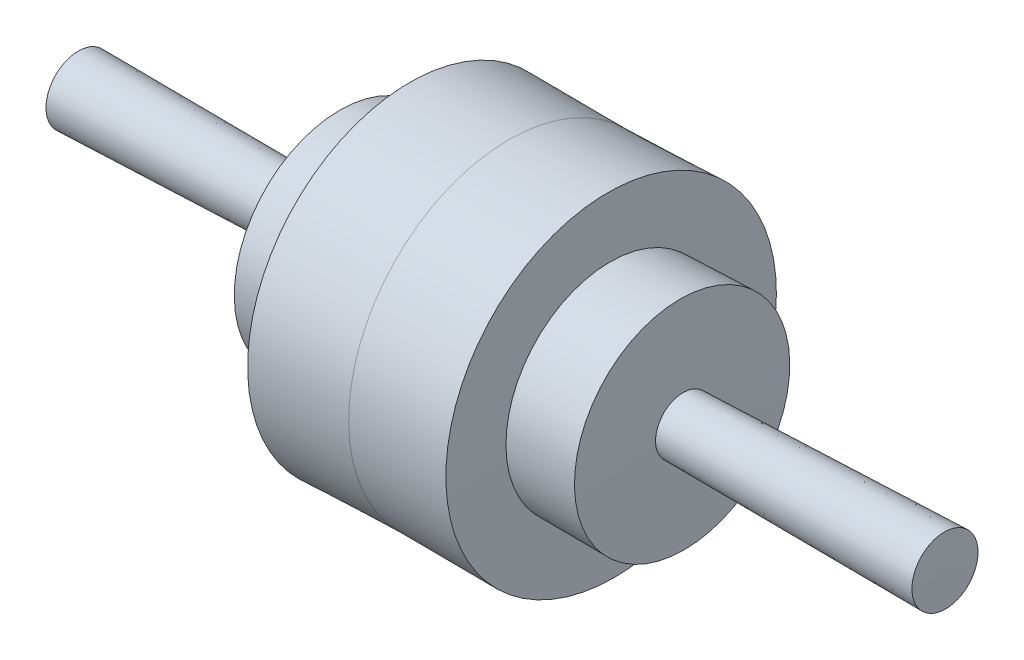
ISO-10303-21;
HEADER;
FILE_DESCRIPTION(('STEP AP214'),'2;1');
FILE_NAME('part.step','',(''),(''),'','','');
FILE_SCHEMA(('AUTOMOTIVE_DESIGN { 1 0 10303 214 1 1 1 1 }'));
ENDSEC;
DATA;
#1=APPLICATION_CONTEXT('core data for automotive mechanical design processes');
#2=APPLICATION_PROTOCOL_DEFINITION('international standard','automotive_design',2000,#1);
#3=PRODUCT_CONTEXT('',#1,'mechanical');
#4=PRODUCT('Part','Part','',(#3));
#5=PRODUCT_RELATED_PRODUCT_CATEGORY('part','',(#4));
#6=PRODUCT_DEFINITION_FORMATION('','',#4);
#7=PRODUCT_DEFINITION_CONTEXT('part definition',#1,'design');
#8=PRODUCT_DEFINITION('design','',#6,#7);
#9=PRODUCT_DEFINITION_SHAPE('','',#8);
#10=(LENGTH_UNIT() NAMED_UNIT(*) SI_UNIT(.MILLI.,.METRE.));
#11=(NAMED_UNIT(*) PLANE_ANGLE_UNIT() SI_UNIT($,.RADIAN.));
#12=(NAMED_UNIT(*) SI_UNIT($,.STERADIAN.) SOLID_ANGLE_UNIT());
#13=UNCERTAINTY_MEASURE_WITH_UNIT(LENGTH_MEASURE(1.E-05),#10,'distance_accuracy_value','');
#14=(GEOMETRIC_REPRESENTATION_CONTEXT(3) GLOBAL_UNCERTAINTY_ASSIGNED_CONTEXT((#13)) GLOBAL_UNIT_ASSIGNED_CONTEXT((#10,
#11,#12)) REPRESENTATION_CONTEXT('',''));
#15=CARTESIAN_POINT('',(0.,0.,0.));
#16=DIRECTION('',(0.,0.,1.));
#17=DIRECTION('',(1.,0.,0.));
#18=AXIS2_PLACEMENT_3D('',#15,#16,#17);
#19=CARTESIAN_POINT('',(-51.92007745854,-0.985960103291799,0.));
#20=DIRECTION('',(-0.999819739495317,-0.0189865351108762,0.));
#21=DIRECTION('',(0.0189865351108762,-0.999819739495317,0.));
#22=AXIS2_PLACEMENT_3D('',#19,#20,#21);
#23=CONICAL_SURFACE('',#22,8.4962984432941,0.0189876760339423);
#24=CARTESIAN_POINT('',(-130.994933695762,-2.48758832188784,0.));
#25=DIRECTION('',(-0.999819739495317,-0.0189865351108762,0.));
#26=DIRECTION('',(0.0189865351108762,-0.999819739495317,0.));
#27=AXIS2_PLACEMENT_3D('',#24,#25,#26);
#28=CIRCLE('',#27,9.99819739495315);
#29=CARTESIAN_POINT('',(-130.805102569878,-12.4839834367327,0.));
#30=VERTEX_POINT('',#29);
#31=EDGE_CURVE('E57',#30,#30,#28,.T.);
#32=ORIENTED_EDGE('',*,*,#31,.F.);
#33=EDGE_LOOP('',(#32));
#34=FACE_BOUND('',#33,.T.);
#35=CARTESIAN_POINT('',(-51.92007745854,-0.985960103291799,0.));
#36=DIRECTION('',(-0.999819739495317,-0.0189865351108762,0.));
#37=DIRECTION('',(0.0189865351108762,-0.999819739495317,0.));
#38=AXIS2_PLACEMENT_3D('',#35,#36,#37);
#39=CIRCLE('',#38,8.4962984432941);
#40=CARTESIAN_POINT('',(-52.0813927272461,7.50880679295703,0.));
#41=VERTEX_POINT('',#40);
#42=EDGE_CURVE('E11',#41,#41,#39,.T.);
#43=ORIENTED_EDGE('',*,*,#42,.T.);
#44=EDGE_LOOP('',(#43));
#45=FACE_BOUND('',#44,.T.);
#46=ADVANCED_FACE('F33',(#34,#45),#23,.T.);
#47=CARTESIAN_POINT('',(-51.4631342870471,-0.977282771542373,0.));
#48=DIRECTION('',(0.999819739495317,0.0189865351108762,0.));
#49=DIRECTION('',(-0.0189865351108762,0.999819739495317,0.));
#50=AXIS2_PLACEMENT_3D('',#47,#48,#49);
#51=CONICAL_SURFACE('',#50,32.5629945953029,1.55180865076095);
#52=CARTESIAN_POINT('',(-51.4631342870471,-0.977282771542373,0.));
#53=DIRECTION('',(-0.999819739495317,-0.0189865351108762,0.));
#54=DIRECTION('',(0.0189865351108762,-0.999819739495317,0.));
#55=AXIS2_PLACEMENT_3D('',#52,#53,#54);
#56=CIRCLE('',#55,32.5629945953029);
#57=CARTESIAN_POINT('',(-52.0813927272461,31.5798420019206,0.));
#58=VERTEX_POINT('',#57);
#59=EDGE_CURVE('E40',#58,#58,#56,.T.);
#60=CARTESIAN_POINT('',(-52.0813927272461,7.50880679295703,0.));
#61=CARTESIAN_POINT('',(-52.0813927272461,7.75954674305041,0.));
#62=CARTESIAN_POINT('',(-52.0813927272461,8.01028669314378,0.));
#63=CARTESIAN_POINT('',(-52.0813927272461,8.51176659333052,0.));
#64=CARTESIAN_POINT('',(-52.0813927272461,8.76250654342389,0.));
#65=CARTESIAN_POINT('',(-52.0813927272461,9.26398644361063,0.));
#66=CARTESIAN_POINT('',(-52.0813927272461,9.514726393704,0.));
#67=CARTESIAN_POINT('',(-52.0813927272461,10.0162062938907,0.));
#68=CARTESIAN_POINT('',(-52.0813927272461,10.2669462439841,0.));
#69=CARTESIAN_POINT('',(-52.0813927272461,10.7684261441708,0.));
#70=CARTESIAN_POINT('',(-52.0813927272461,11.0191660942642,0.));
#71=CARTESIAN_POINT('',(-52.0813927272461,11.520645994451,0.));
#72=CARTESIAN_POINT('',(-52.0813927272461,11.7713859445443,0.));
#73=CARTESIAN_POINT('',(-52.0813927272461,12.2728658447311,0.));
#74=CARTESIAN_POINT('',(-52.0813927272461,12.5236057948244,0.));
#75=CARTESIAN_POINT('',(-52.0813927272461,13.0250856950112,0.));
#76=CARTESIAN_POINT('',(-52.0813927272461,13.2758256451046,0.));
#77=CARTESIAN_POINT('',(-52.0813927272461,13.7773055452913,0.));
#78=CARTESIAN_POINT('',(-52.0813927272461,14.0280454953847,0.));
#79=CARTESIAN_POINT('',(-52.0813927272461,14.5295253955714,0.));
#80=CARTESIAN_POINT('',(-52.0813927272461,14.7802653456648,0.));
#81=CARTESIAN_POINT('',(-52.0813927272461,15.2817452458515,0.));
#82=CARTESIAN_POINT('',(-52.0813927272461,15.5324851959449,0.));
#83=CARTESIAN_POINT('',(-52.0813927272461,16.0339650961316,0.));
#84=CARTESIAN_POINT('',(-52.0813927272461,16.284705046225,0.));
#85=CARTESIAN_POINT('',(-52.0813927272461,16.7861849464117,0.));
#86=CARTESIAN_POINT('',(-52.0813927272461,17.0369248965051,0.));
#87=CARTESIAN_POINT('',(-52.0813927272461,17.5384047966918,0.));
#88=CARTESIAN_POINT('',(-52.0813927272461,17.7891447467852,0.));
#89=CARTESIAN_POINT('',(-52.0813927272461,18.290624646972,0.));
#90=CARTESIAN_POINT('',(-52.0813927272461,18.5413645970653,0.));
#91=CARTESIAN_POINT('',(-52.0813927272461,19.0428444972521,0.));
#92=CARTESIAN_POINT('',(-52.0813927272461,19.2935844473454,0.));
#93=CARTESIAN_POINT('',(-52.0813927272461,19.7950643475322,0.));
#94=CARTESIAN_POINT('',(-52.0813927272461,20.0458042976255,0.));
#95=CARTESIAN_POINT('',(-52.0813927272461,20.5472841978123,0.));
#96=CARTESIAN_POINT('',(-52.0813927272461,20.7980241479057,0.));
#97=CARTESIAN_POINT('',(-52.0813927272461,21.2995040480924,0.));
#98=CARTESIAN_POINT('',(-52.0813927272461,21.5502439981858,0.));
#99=CARTESIAN_POINT('',(-52.0813927272461,22.0517238983725,0.));
#100=CARTESIAN_POINT('',(-52.0813927272461,22.3024638484659,0.));
#101=CARTESIAN_POINT('',(-52.0813927272461,22.8039437486526,0.));
#102=CARTESIAN_POINT('',(-52.0813927272461,23.054683698746,0.));
#103=CARTESIAN_POINT('',(-52.0813927272461,23.5561635989327,0.));
#104=CARTESIAN_POINT('',(-52.0813927272461,23.8069035490261,0.));
#105=CARTESIAN_POINT('',(-52.0813927272461,24.3083834492128,0.));
#106=CARTESIAN_POINT('',(-52.0813927272461,24.5591233993062,0.));
#107=CARTESIAN_POINT('',(-52.0813927272461,25.0606032994929,0.));
#108=CARTESIAN_POINT('',(-52.0813927272461,25.3113432495863,0.));
#109=CARTESIAN_POINT('',(-52.0813927272461,25.8128231497731,0.));
#110=CARTESIAN_POINT('',(-52.0813927272461,26.0635630998664,0.));
#111=CARTESIAN_POINT('',(-52.0813927272461,26.5650430000532,0.));
#112=CARTESIAN_POINT('',(-52.0813927272461,26.8157829501465,0.));
#113=CARTESIAN_POINT('',(-52.0813927272461,27.3172628503333,0.));
#114=CARTESIAN_POINT('',(-52.0813927272461,27.5680028004267,0.));
#115=CARTESIAN_POINT('',(-52.0813927272461,28.0694827006134,0.));
#116=CARTESIAN_POINT('',(-52.0813927272461,28.3202226507068,0.));
#117=CARTESIAN_POINT('',(-52.0813927272461,28.8217025508935,0.));
#118=CARTESIAN_POINT('',(-52.0813927272461,29.0724425009869,0.));
#119=CARTESIAN_POINT('',(-52.0813927272461,29.5739224011736,0.));
#120=CARTESIAN_POINT('',(-52.0813927272461,29.824662351267,0.));
#121=CARTESIAN_POINT('',(-52.0813927272461,30.3261422514537,0.));
#122=CARTESIAN_POINT('',(-52.0813927272461,30.5768822015471,0.));
#123=CARTESIAN_POINT('',(-52.0813927272461,31.0783621017338,0.));
#124=CARTESIAN_POINT('',(-52.0813927272461,31.3291020518272,0.));
#125=CARTESIAN_POINT('',(-52.0813927272461,31.5798420019206,0.));
#126=B_SPLINE_CURVE_WITH_KNOTS('',3,(#60,#61,#62,#63,#64,#65,#66,#67,#68,#69,#70,#71,#72,#73,
#74,#75,#76,#77,#78,#79,#80,#81,#82,#83,#84,#85,#86,#87,#88,#89,#90,#91,#92,#93,#94,#95,#96,#97,
#98,#99,#100,#101,#102,#103,#104,#105,#106,#107,#108,#109,#110,#111,#112,#113,#114,#115,#116,
#117,#118,#119,#120,#121,#122,#123,#124,#125),.UNSPECIFIED.,.F.,.F.,(4,2,2,2,2,2,2,2,2,2,2,2,2,
2,2,2,2,2,2,2,2,2,2,2,2,2,2,2,2,2,2,2,4),(0.,0.752219850280115,1.50443970056023,
2.25665955084034,3.00887940112044,3.76109925140055,4.51331910168066,5.26553895196078,
6.01775880224089,6.769978652521,7.52219850280111,8.27441835308122,9.02663820336133,
9.77885805364144,10.5310779039216,11.2832977542017,12.0355176044818,12.7877374547619,
13.539957305042,14.2921771553221,15.0443970056022,15.7966168558823,16.5488367061624,
17.3010565564425,18.0532764067227,18.8054962570028,19.5577161072829,20.309935957563,
21.0621558078431,21.8143756581232,22.5665955084033,23.3188153586834,24.0710352089635),.UNSPECIFIED.);
#127=EDGE_CURVE('BSEAM84',#41,#58,#126,.T.);
#128=ORIENTED_EDGE('',*,*,#42,.F.);
#129=ORIENTED_EDGE('',*,*,#59,.T.);
#130=ORIENTED_EDGE('',*,*,#127,.T.);
#131=ORIENTED_EDGE('',*,*,#127,.F.);
#132=EDGE_LOOP('',(#128,#130,#129,#131));
#133=FACE_BOUND('',#132,.T.);
#134=ADVANCED_FACE('F84',(#133),#51,.T.);
#135=CARTESIAN_POINT('',(-30.3277043610993,-0.575921839645757,0.));
#136=DIRECTION('',(-0.999819739495317,-0.0189865351108762,0.));
#137=DIRECTION('',(0.0189865351108762,-0.999819739495317,0.));
#138=AXIS2_PLACEMENT_3D('',#135,#136,#137);
#139=CONICAL_SURFACE('',#138,32.161561300838,0.0189876760339422);
#140=ORIENTED_EDGE('',*,*,#59,.F.);
#141=EDGE_LOOP('',(#140));
#142=FACE_BOUND('',#141,.T.);
#143=CARTESIAN_POINT('',(-30.3277043610993,-0.575921839645757,0.));
#144=DIRECTION('',(-0.999819739495317,-0.0189865351108762,0.));
#145=DIRECTION('',(0.0189865351108762,-0.999819739495317,0.));
#146=AXIS2_PLACEMENT_3D('',#143,#144,#145);
#147=CIRCLE('',#146,32.161561300838);
#148=CARTESIAN_POINT('',(-29.7170677482403,-32.7316856812123,0.));
#149=VERTEX_POINT('',#148);
#150=EDGE_CURVE('E79',#149,#149,#147,.T.);
#151=ORIENTED_EDGE('',*,*,#150,.T.);
#152=EDGE_LOOP('',(#151));
#153=FACE_BOUND('',#152,.T.);
#154=ADVANCED_FACE('F86',(#142,#153),#139,.T.);
#155=CARTESIAN_POINT('',(-29.9891853445345,-0.569493377654248,0.));
#156=DIRECTION('',(0.999819739495317,0.0189865351108762,0.));
#157=DIRECTION('',(-0.0189865351108762,0.999819739495317,0.));
#158=AXIS2_PLACEMENT_3D('',#155,#156,#157);
#159=CONICAL_SURFACE('',#158,49.9909869747659,1.55180865076095);
#160=ORIENTED_EDGE('',*,*,#150,.F.);
#161=EDGE_LOOP('',(#160));
#162=FACE_BOUND('',#161,.T.);
#163=CARTESIAN_POINT('',(-29.9891853445345,-0.569493377654248,0.));
#164=DIRECTION('',(-0.999819739495317,-0.0189865351108762,0.));
#165=DIRECTION('',(0.0189865351108762,-0.999819739495317,0.));
#166=AXIS2_PLACEMENT_3D('',#163,#164,#165);
#167=CIRCLE('',#166,49.9909869747659);
#168=CARTESIAN_POINT('',(-29.0400297151107,-50.5514689518785,0.));
#169=VERTEX_POINT('',#168);
#170=EDGE_CURVE('E76',#169,#169,#167,.T.);
#171=ORIENTED_EDGE('',*,*,#170,.T.);
#172=EDGE_LOOP('',(#171));
#173=FACE_BOUND('',#172,.T.);
#174=ADVANCED_FACE('F89',(#162,#173),#159,.T.);
#175=CARTESIAN_POINT('',(0.,0.,0.));
#176=DIRECTION('',(-0.999819739495317,-0.0189865351108762,0.));
#177=DIRECTION('',(0.0189865351108762,-0.999819739495317,0.));
#178=AXIS2_PLACEMENT_3D('',#175,#176,#177);
#179=CONICAL_SURFACE('',#178,49.4213909214396,0.0189876760339426);
#180=ORIENTED_EDGE('',*,*,#170,.F.);
#181=EDGE_LOOP('',(#180));
#182=FACE_BOUND('',#181,.T.);
#183=CARTESIAN_POINT('',(0.,0.,0.));
#184=DIRECTION('',(-0.999819739495317,-0.0189865351108762,0.));
#185=DIRECTION('',(0.0189865351108762,-0.999819739495317,0.));
#186=AXIS2_PLACEMENT_3D('',#183,#184,#185);
#187=CIRCLE('',#186,49.4213909214396);
#188=CARTESIAN_POINT('',(0.938340973958306,-49.4124821965699,0.));
#189=VERTEX_POINT('',#188);
#190=EDGE_CURVE('E73',#189,#189,#187,.T.);
#191=ORIENTED_EDGE('',*,*,#190,.T.);
#192=EDGE_LOOP('',(#191));
#193=FACE_BOUND('',#192,.T.);
#194=ADVANCED_FACE('F95',(#182,#193),#179,.T.);
#195=CARTESIAN_POINT('',(0.,0.,0.));
#196=DIRECTION('',(0.999819739495317,0.0189865351108762,0.));
#197=DIRECTION('',(-0.0189865351108762,0.999819739495317,0.));
#198=AXIS2_PLACEMENT_3D('',#195,#196,#197);
#199=CONICAL_SURFACE('',#198,49.4213909214396,0.0189876760339422);
#200=CARTESIAN_POINT('',(29.9891853445346,0.569493377654248,0.));
#201=DIRECTION('',(-0.999819739495317,-0.0189865351108762,0.));
#202=DIRECTION('',(0.0189865351108762,-0.999819739495317,0.));
#203=AXIS2_PLACEMENT_3D('',#200,#201,#202);
#204=CIRCLE('',#203,49.9909869747659);
#205=CARTESIAN_POINT('',(30.9383409739583,-49.4124821965699,0.));
#206=VERTEX_POINT('',#205);
#207=EDGE_CURVE('E70',#206,#206,#204,.T.);
#208=ORIENTED_EDGE('',*,*,#207,.T.);
#209=EDGE_LOOP('',(#208));
#210=FACE_BOUND('',#209,.T.);
#211=ORIENTED_EDGE('',*,*,#190,.F.);
#212=EDGE_LOOP('',(#211));
#213=FACE_BOUND('',#212,.T.);
#214=ADVANCED_FACE('F101',(#210,#213),#199,.T.);
#215=CARTESIAN_POINT('',(29.9891853445346,0.569493377654248,0.));
#216=DIRECTION('',(-0.999819739495317,-0.0189865351108762,0.));
#217=DIRECTION('',(0.0189865351108762,-0.999819739495317,0.));
#218=AXIS2_PLACEMENT_3D('',#215,#216,#217);
#219=CONICAL_SURFACE('',#218,49.9909869747658,1.55180865076096);
#220=CARTESIAN_POINT('',(30.3277043610993,0.575921839645757,0.));
#221=DIRECTION('',(-0.999819739495317,-0.0189865351108762,0.));
#222=DIRECTION('',(0.0189865351108762,-0.999819739495317,0.));
#223=AXIS2_PLACEMENT_3D('',#220,#221,#222);
#224=CIRCLE('',#223,32.161561300838);
#225=CARTESIAN_POINT('',(30.9383409739583,-31.5798420019208,0.));
#226=VERTEX_POINT('',#225);
#227=EDGE_CURVE('E67',#226,#226,#224,.T.);
#228=ORIENTED_EDGE('',*,*,#227,.T.);
#229=EDGE_LOOP('',(#228));
#230=FACE_BOUND('',#229,.T.);
#231=ORIENTED_EDGE('',*,*,#207,.F.);
#232=EDGE_LOOP('',(#231));
#233=FACE_BOUND('',#232,.T.);
#234=ADVANCED_FACE('F106',(#230,#233),#219,.T.);
#235=CARTESIAN_POINT('',(30.3277043610993,0.575921839645757,0.));
#236=DIRECTION('',(0.999819739495317,0.0189865351108762,0.));
#237=DIRECTION('',(-0.0189865351108762,0.999819739495317,0.));
#238=AXIS2_PLACEMENT_3D('',#235,#236,#237);
#239=CONICAL_SURFACE('',#238,32.161561300838,0.0189876760339425);
#240=CARTESIAN_POINT('',(51.4631342870472,0.977282771542372,0.));
#241=DIRECTION('',(-0.999819739495317,-0.0189865351108762,0.));
#242=DIRECTION('',(0.0189865351108762,-0.999819739495317,0.));
#243=AXIS2_PLACEMENT_3D('',#240,#241,#242);
#244=CIRCLE('',#243,32.5629945953029);
#245=CARTESIAN_POINT('',(52.0813927272461,-31.5798420019206,0.));
#246=VERTEX_POINT('',#245);
#247=EDGE_CURVE('E60',#246,#246,#244,.T.);
#248=ORIENTED_EDGE('',*,*,#247,.T.);
#249=EDGE_LOOP('',(#248));
#250=FACE_BOUND('',#249,.T.);
#251=ORIENTED_EDGE('',*,*,#227,.F.);
#252=EDGE_LOOP('',(#251));
#253=FACE_BOUND('',#252,.T.);
#254=ADVANCED_FACE('F112',(#250,#253),#239,.T.);
#255=CARTESIAN_POINT('',(51.4631342870472,0.977282771542372,0.));
#256=DIRECTION('',(-0.999819739495317,-0.0189865351108762,0.));
#257=DIRECTION('',(0.0189865351108762,-0.999819739495317,0.));
#258=AXIS2_PLACEMENT_3D('',#255,#256,#257);
#259=CONICAL_SURFACE('',#258,32.5629945953029,1.55180865076095);
#260=CARTESIAN_POINT('',(51.9200774585401,0.985960103291798,0.));
#261=DIRECTION('',(-0.999819739495317,-0.0189865351108762,0.));
#262=DIRECTION('',(0.0189865351108762,-0.999819739495317,0.));
#263=AXIS2_PLACEMENT_3D('',#260,#261,#262);
#264=CIRCLE('',#263,8.4962984432941);
#265=CARTESIAN_POINT('',(52.0813927272462,-7.50880679295703,0.));
#266=VERTEX_POINT('',#265);
#267=EDGE_CURVE('E56',#266,#266,#264,.T.);
#268=CARTESIAN_POINT('',(52.0813927272462,-7.50880679295703,0.));
#269=CARTESIAN_POINT('',(52.0813927272462,-7.75954674305041,0.));
#270=CARTESIAN_POINT('',(52.0813927272462,-8.01028669314378,0.));
#271=CARTESIAN_POINT('',(52.0813927272462,-8.51176659333052,0.));
#272=CARTESIAN_POINT('',(52.0813927272462,-8.76250654342389,0.));
#273=CARTESIAN_POINT('',(52.0813927272462,-9.26398644361063,0.));
#274=CARTESIAN_POINT('',(52.0813927272462,-9.514726393704,0.));
#275=CARTESIAN_POINT('',(52.0813927272462,-10.0162062938907,0.));
#276=CARTESIAN_POINT('',(52.0813927272462,-10.2669462439841,0.));
#277=CARTESIAN_POINT('',(52.0813927272462,-10.7684261441708,0.));
#278=CARTESIAN_POINT('',(52.0813927272462,-11.0191660942642,0.));
#279=CARTESIAN_POINT('',(52.0813927272462,-11.520645994451,0.));
#280=CARTESIAN_POINT('',(52.0813927272462,-11.7713859445443,0.));
#281=CARTESIAN_POINT('',(52.0813927272462,-12.2728658447311,0.));
#282=CARTESIAN_POINT('',(52.0813927272462,-12.5236057948244,0.));
#283=CARTESIAN_POINT('',(52.0813927272462,-13.0250856950112,0.));
#284=CARTESIAN_POINT('',(52.0813927272462,-13.2758256451046,0.));
#285=CARTESIAN_POINT('',(52.0813927272462,-13.7773055452913,0.));
#286=CARTESIAN_POINT('',(52.0813927272462,-14.0280454953847,0.));
#287=CARTESIAN_POINT('',(52.0813927272462,-14.5295253955714,0.));
#288=CARTESIAN_POINT('',(52.0813927272462,-14.7802653456648,0.));
#289=CARTESIAN_POINT('',(52.0813927272462,-15.2817452458515,0.));
#290=CARTESIAN_POINT('',(52.0813927272462,-15.5324851959449,0.));
#291=CARTESIAN_POINT('',(52.0813927272462,-16.0339650961316,0.));
#292=CARTESIAN_POINT('',(52.0813927272462,-16.284705046225,0.));
#293=CARTESIAN_POINT('',(52.0813927272462,-16.7861849464117,0.));
#294=CARTESIAN_POINT('',(52.0813927272462,-17.0369248965051,0.));
#295=CARTESIAN_POINT('',(52.0813927272462,-17.5384047966918,0.));
#296=CARTESIAN_POINT('',(52.0813927272462,-17.7891447467852,0.));
#297=CARTESIAN_POINT('',(52.0813927272462,-18.290624646972,0.));
#298=CARTESIAN_POINT('',(52.0813927272462,-18.5413645970653,0.));
#299=CARTESIAN_POINT('',(52.0813927272462,-19.0428444972521,0.));
#300=CARTESIAN_POINT('',(52.0813927272462,-19.2935844473454,0.));
#301=CARTESIAN_POINT('',(52.0813927272462,-19.7950643475322,0.));
#302=CARTESIAN_POINT('',(52.0813927272461,-20.0458042976256,0.));
#303=CARTESIAN_POINT('',(52.0813927272461,-20.5472841978123,0.));
#304=CARTESIAN_POINT('',(52.0813927272461,-20.7980241479057,0.));
#305=CARTESIAN_POINT('',(52.0813927272461,-21.2995040480924,0.));
#306=CARTESIAN_POINT('',(52.0813927272461,-21.5502439981858,0.));
#307=CARTESIAN_POINT('',(52.0813927272461,-22.0517238983725,0.));
#308=CARTESIAN_POINT('',(52.0813927272461,-22.3024638484659,0.));
#309=CARTESIAN_POINT('',(52.0813927272461,-22.8039437486526,0.));
#310=CARTESIAN_POINT('',(52.0813927272461,-23.054683698746,0.));
#311=CARTESIAN_POINT('',(52.0813927272461,-23.5561635989327,0.));
#312=CARTESIAN_POINT('',(52.0813927272461,-23.8069035490261,0.));
#313=CARTESIAN_POINT('',(52.0813927272461,-24.3083834492128,0.));
#314=CARTESIAN_POINT('',(52.0813927272461,-24.5591233993062,0.));
#315=CARTESIAN_POINT('',(52.0813927272461,-25.060603299493,0.));
#316=CARTESIAN_POINT('',(52.0813927272461,-25.3113432495863,0.));
#317=CARTESIAN_POINT('',(52.0813927272461,-25.8128231497731,0.));
#318=CARTESIAN_POINT('',(52.0813927272461,-26.0635630998664,0.));
#319=CARTESIAN_POINT('',(52.0813927272461,-26.5650430000532,0.));
#320=CARTESIAN_POINT('',(52.0813927272461,-26.8157829501465,0.));
#321=CARTESIAN_POINT('',(52.0813927272461,-27.3172628503333,0.));
#322=CARTESIAN_POINT('',(52.0813927272461,-27.5680028004267,0.));
#323=CARTESIAN_POINT('',(52.0813927272461,-28.0694827006134,0.));
#324=CARTESIAN_POINT('',(52.0813927272461,-28.3202226507068,0.));
#325=CARTESIAN_POINT('',(52.0813927272461,-28.8217025508935,0.));
#326=CARTESIAN_POINT('',(52.0813927272461,-29.0724425009869,0.));
#327=CARTESIAN_POINT('',(52.0813927272461,-29.5739224011736,0.));
#328=CARTESIAN_POINT('',(52.0813927272461,-29.824662351267,0.));
#329=CARTESIAN_POINT('',(52.0813927272461,-30.3261422514537,0.));
#330=CARTESIAN_POINT('',(52.0813927272461,-30.5768822015471,0.));
#331=CARTESIAN_POINT('',(52.0813927272461,-31.0783621017338,0.));
#332=CARTESIAN_POINT('',(52.0813927272461,-31.3291020518272,0.));
#333=CARTESIAN_POINT('',(52.0813927272461,-31.5798420019206,0.));
#334=B_SPLINE_CURVE_WITH_KNOTS('',3,(#268,#269,#270,#271,#272,#273,#274,#275,#276,#277,#278,
#279,#280,#281,#282,#283,#284,#285,#286,#287,#288,#289,#290,#291,#292,#293,#294,#295,#296,#297,
#298,#299,#300,#301,#302,#303,#304,#305,#306,#307,#308,#309,#310,#311,#312,#313,#314,#315,#316,
#317,#318,#319,#320,#321,#322,#323,#324,#325,#326,#327,#328,#329,#330,#331,#332,#333),
.UNSPECIFIED.,.F.,.F.,(4,2,2,2,2,2,2,2,2,2,2,2,2,2,2,2,2,2,2,2,2,2,2,2,2,2,2,2,2,2,2,2,4),(0.,
0.752219850280115,1.50443970056023,2.25665955084034,3.00887940112044,3.76109925140055,
4.51331910168066,5.26553895196078,6.01775880224089,6.769978652521,7.52219850280111,
8.27441835308122,9.02663820336134,9.77885805364144,10.5310779039216,11.2832977542017,
12.0355176044818,12.7877374547619,13.539957305042,14.2921771553221,15.0443970056022,
15.7966168558823,16.5488367061624,17.3010565564425,18.0532764067227,18.8054962570028,
19.5577161072829,20.309935957563,21.0621558078431,21.8143756581232,22.5665955084033,
23.3188153586834,24.0710352089635),.UNSPECIFIED.);
#335=EDGE_CURVE('BSEAM132',#266,#246,#334,.T.);
#336=ORIENTED_EDGE('',*,*,#267,.T.);
#337=ORIENTED_EDGE('',*,*,#247,.F.);
#338=ORIENTED_EDGE('',*,*,#335,.T.);
#339=ORIENTED_EDGE('',*,*,#335,.F.);
#340=EDGE_LOOP('',(#336,#338,#337,#339));
#341=FACE_BOUND('',#340,.T.);
#342=ADVANCED_FACE('F132',(#341),#259,.T.);
#343=CARTESIAN_POINT('',(51.9200774585401,0.985960103291798,0.));
#344=DIRECTION('',(0.999819739495317,0.0189865351108762,0.));
#345=DIRECTION('',(-0.0189865351108762,0.999819739495317,0.));
#346=AXIS2_PLACEMENT_3D('',#343,#344,#345);
#347=CONICAL_SURFACE('',#346,8.4962984432941,0.0189876760339424);
#348=CARTESIAN_POINT('',(130.994933695762,2.48758832188784,0.));
#349=DIRECTION('',(-0.999819739495317,-0.0189865351108762,0.));
#350=DIRECTION('',(0.0189865351108762,-0.999819739495317,0.));
#351=AXIS2_PLACEMENT_3D('',#348,#349,#350);
#352=CIRCLE('',#351,9.99819739495315);
#353=CARTESIAN_POINT('',(131.184764821647,-7.50880679295697,0.));
#354=VERTEX_POINT('',#353);
#355=EDGE_CURVE('E54',#354,#354,#352,.T.);
#356=ORIENTED_EDGE('',*,*,#355,.T.);
#357=EDGE_LOOP('',(#356));
#358=FACE_BOUND('',#357,.T.);
#359=ORIENTED_EDGE('',*,*,#267,.F.);
#360=EDGE_LOOP('',(#359));
#361=FACE_BOUND('',#360,.T.);
#362=ADVANCED_FACE('F50',(#358,#361),#347,.T.);
#363=CARTESIAN_POINT('',(130.994933695762,2.48758832188784,0.));
#364=DIRECTION('',(-0.999819739495317,-0.0189865351108762,0.));
#365=DIRECTION('',(0.0189865351108762,-0.999819739495317,0.));
#366=AXIS2_PLACEMENT_3D('',#363,#364,#365);
#367=CONICAL_SURFACE('',#366,9.99819739495314,1.55180865076096);
#368=CARTESIAN_POINT('',(131.184764821647,2.491193207043,0.));
#369=VERTEX_POINT('',#368);
#370=VERTEX_LOOP('',#369);
#371=FACE_BOUND('',#370,.T.);
#372=ORIENTED_EDGE('',*,*,#355,.F.);
#373=EDGE_LOOP('',(#372));
#374=FACE_BOUND('',#373,.T.);
#375=ADVANCED_FACE('F46',(#371,#374),#367,.T.);
#376=CARTESIAN_POINT('',(-130.994933695762,-2.48758832188784,0.));
#377=DIRECTION('',(0.999819739495317,0.0189865351108762,0.));
#378=DIRECTION('',(-0.0189865351108762,0.999819739495317,0.));
#379=AXIS2_PLACEMENT_3D('',#376,#377,#378);
#380=CONICAL_SURFACE('',#379,9.99819739495315,1.55180865076095);
#381=CARTESIAN_POINT('',(-131.184764821647,-2.49119320704301,0.));
#382=VERTEX_POINT('',#381);
#383=VERTEX_LOOP('',#382);
#384=FACE_BOUND('',#383,.T.);
#385=ORIENTED_EDGE('',*,*,#31,.T.);
#386=EDGE_LOOP('',(#385));
#387=FACE_BOUND('',#386,.T.);
#388=ADVANCED_FACE('F49',(#384,#387),#380,.T.);
#389=CLOSED_SHELL('',(#46,#134,#154,#174,#194,#214,#234,#254,#342,#362,#375,#388));
#390=MANIFOLD_SOLID_BREP('B2',#389);
#391=ADVANCED_BREP_SHAPE_REPRESENTATION('',(#18,#390),#14);
#392=SHAPE_DEFINITION_REPRESENTATION(#9,#391);
ENDSEC;
END-ISO-10303-21;
